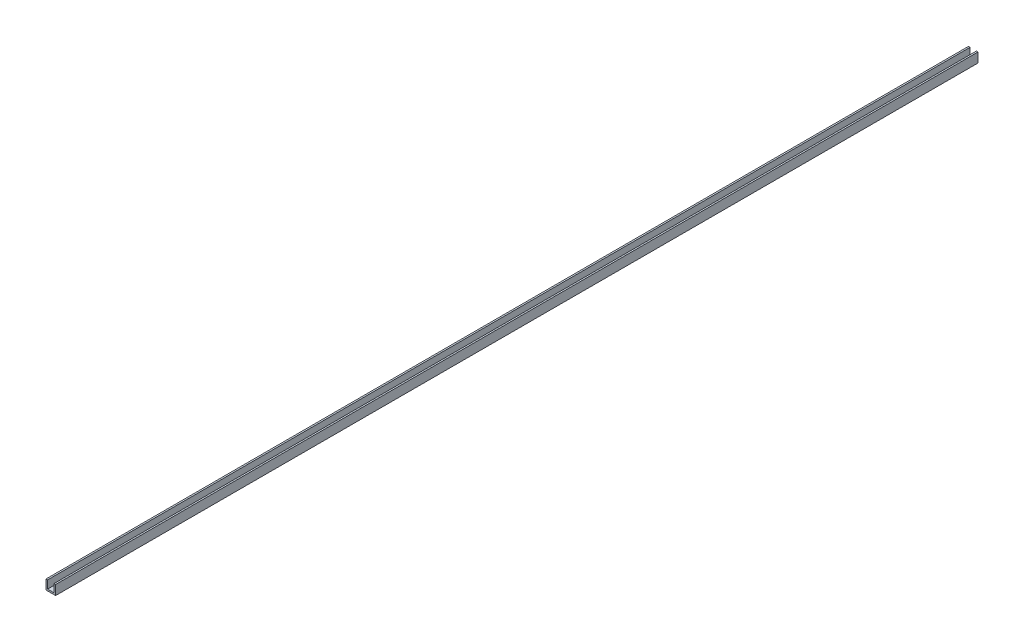
ISO-10303-21;
HEADER;
FILE_DESCRIPTION(('STEP AP214'),'2;1');
FILE_NAME('part.step','',(''),(''),'','','');
FILE_SCHEMA(('AUTOMOTIVE_DESIGN { 1 0 10303 214 1 1 1 1 }'));
ENDSEC;
DATA;
#1=APPLICATION_CONTEXT('core data for automotive mechanical design processes');
#2=APPLICATION_PROTOCOL_DEFINITION('international standard','automotive_design',2000,#1);
#3=PRODUCT_CONTEXT('',#1,'mechanical');
#4=PRODUCT('Part','Part','',(#3));
#5=PRODUCT_RELATED_PRODUCT_CATEGORY('part','',(#4));
#6=PRODUCT_DEFINITION_FORMATION('','',#4);
#7=PRODUCT_DEFINITION_CONTEXT('part definition',#1,'design');
#8=PRODUCT_DEFINITION('design','',#6,#7);
#9=PRODUCT_DEFINITION_SHAPE('','',#8);
#10=(LENGTH_UNIT() NAMED_UNIT(*) SI_UNIT(.MILLI.,.METRE.));
#11=(NAMED_UNIT(*) PLANE_ANGLE_UNIT() SI_UNIT($,.RADIAN.));
#12=(NAMED_UNIT(*) SI_UNIT($,.STERADIAN.) SOLID_ANGLE_UNIT());
#13=UNCERTAINTY_MEASURE_WITH_UNIT(LENGTH_MEASURE(1.E-05),#10,'distance_accuracy_value','');
#14=(GEOMETRIC_REPRESENTATION_CONTEXT(3) GLOBAL_UNCERTAINTY_ASSIGNED_CONTEXT((#13)) GLOBAL_UNIT_ASSIGNED_CONTEXT((#10,
#11,#12)) REPRESENTATION_CONTEXT('',''));
#15=CARTESIAN_POINT('',(0.,0.,0.));
#16=DIRECTION('',(0.,0.,1.));
#17=DIRECTION('',(1.,0.,0.));
#18=AXIS2_PLACEMENT_3D('',#15,#16,#17);
#19=CARTESIAN_POINT('',(3.175,0.,1828.8));
#20=DIRECTION('',(0.,-1.,0.));
#21=DIRECTION('',(0.,0.,-1.));
#22=AXIS2_PLACEMENT_3D('',#19,#20,#21);
#23=PLANE('',#22);
#24=DIRECTION('',(-1.,0.,0.));
#25=VECTOR('',#24,1.);
#26=CARTESIAN_POINT('',(3.175,0.,0.));
#27=LINE('',#26,#25);
#28=CARTESIAN_POINT('',(3.175,0.,0.));
#29=VERTEX_POINT('',#28);
#30=CARTESIAN_POINT('',(0.,0.,0.));
#31=VERTEX_POINT('',#30);
#32=EDGE_CURVE('E129',#29,#31,#27,.T.);
#33=ORIENTED_EDGE('',*,*,#32,.T.);
#34=DIRECTION('',(0.,0.,-1.));
#35=VECTOR('',#34,1.);
#36=CARTESIAN_POINT('',(0.,0.,1828.8));
#37=LINE('',#36,#35);
#38=CARTESIAN_POINT('',(0.,0.,1828.8));
#39=VERTEX_POINT('',#38);
#40=EDGE_CURVE('E11',#39,#31,#37,.T.);
#41=ORIENTED_EDGE('',*,*,#40,.F.);
#42=DIRECTION('',(-1.,0.,0.));
#43=VECTOR('',#42,1.);
#44=CARTESIAN_POINT('',(3.175,0.,1828.8));
#45=LINE('',#44,#43);
#46=CARTESIAN_POINT('',(3.175,0.,1828.8));
#47=VERTEX_POINT('',#46);
#48=EDGE_CURVE('E143',#47,#39,#45,.T.);
#49=ORIENTED_EDGE('',*,*,#48,.F.);
#50=DIRECTION('',(0.,0.,-1.));
#51=VECTOR('',#50,1.);
#52=CARTESIAN_POINT('',(3.175,0.,1828.8));
#53=LINE('',#52,#51);
#54=EDGE_CURVE('E125',#47,#29,#53,.T.);
#55=ORIENTED_EDGE('',*,*,#54,.T.);
#56=EDGE_LOOP('',(#33,#41,#49,#55));
#57=FACE_BOUND('',#56,.T.);
#58=ADVANCED_FACE('F33',(#57),#23,.F.);
#59=CARTESIAN_POINT('',(0.,0.,1828.8));
#60=DIRECTION('',(1.,0.,0.));
#61=DIRECTION('',(0.,1.,0.));
#62=AXIS2_PLACEMENT_3D('',#59,#60,#61);
#63=PLANE('',#62);
#64=DIRECTION('',(0.,-1.,0.));
#65=VECTOR('',#64,1.);
#66=CARTESIAN_POINT('',(0.,0.,0.));
#67=LINE('',#66,#65);
#68=CARTESIAN_POINT('',(0.,-19.05,0.));
#69=VERTEX_POINT('',#68);
#70=EDGE_CURVE('E132',#31,#69,#67,.T.);
#71=ORIENTED_EDGE('',*,*,#70,.T.);
#72=DIRECTION('',(0.,0.,-1.));
#73=VECTOR('',#72,1.);
#74=CARTESIAN_POINT('',(0.,-19.05,1828.8));
#75=LINE('',#74,#73);
#76=CARTESIAN_POINT('',(0.,-19.05,1828.8));
#77=VERTEX_POINT('',#76);
#78=EDGE_CURVE('E41',#77,#69,#75,.T.);
#79=ORIENTED_EDGE('',*,*,#78,.F.);
#80=DIRECTION('',(0.,-1.,0.));
#81=VECTOR('',#80,1.);
#82=CARTESIAN_POINT('',(0.,0.,1828.8));
#83=LINE('',#82,#81);
#84=EDGE_CURVE('E92',#39,#77,#83,.T.);
#85=ORIENTED_EDGE('',*,*,#84,.F.);
#86=ORIENTED_EDGE('',*,*,#40,.T.);
#87=EDGE_LOOP('',(#71,#79,#85,#86));
#88=FACE_BOUND('',#87,.T.);
#89=ADVANCED_FACE('F178',(#88),#63,.F.);
#90=CARTESIAN_POINT('',(0.,-19.05,1828.8));
#91=DIRECTION('',(0.,1.,0.));
#92=DIRECTION('',(0.,0.,1.));
#93=AXIS2_PLACEMENT_3D('',#90,#91,#92);
#94=PLANE('',#93);
#95=DIRECTION('',(1.,0.,0.));
#96=VECTOR('',#95,1.);
#97=CARTESIAN_POINT('',(0.,-19.05,0.));
#98=LINE('',#97,#96);
#99=CARTESIAN_POINT('',(19.05,-19.05,0.));
#100=VERTEX_POINT('',#99);
#101=EDGE_CURVE('E134',#69,#100,#98,.T.);
#102=ORIENTED_EDGE('',*,*,#101,.T.);
#103=DIRECTION('',(0.,0.,-1.));
#104=VECTOR('',#103,1.);
#105=CARTESIAN_POINT('',(19.05,-19.05,1828.8));
#106=LINE('',#105,#104);
#107=CARTESIAN_POINT('',(19.05,-19.05,1828.8));
#108=VERTEX_POINT('',#107);
#109=EDGE_CURVE('E150',#108,#100,#106,.T.);
#110=ORIENTED_EDGE('',*,*,#109,.F.);
#111=DIRECTION('',(1.,0.,0.));
#112=VECTOR('',#111,1.);
#113=CARTESIAN_POINT('',(0.,-19.05,1828.8));
#114=LINE('',#113,#112);
#115=EDGE_CURVE('E158',#77,#108,#114,.T.);
#116=ORIENTED_EDGE('',*,*,#115,.F.);
#117=ORIENTED_EDGE('',*,*,#78,.T.);
#118=EDGE_LOOP('',(#102,#110,#116,#117));
#119=FACE_BOUND('',#118,.T.);
#120=ADVANCED_FACE('F156',(#119),#94,.F.);
#121=CARTESIAN_POINT('',(19.05,-19.05,1828.8));
#122=DIRECTION('',(-1.,0.,0.));
#123=DIRECTION('',(0.,0.,1.));
#124=AXIS2_PLACEMENT_3D('',#121,#122,#123);
#125=PLANE('',#124);
#126=DIRECTION('',(0.,1.,0.));
#127=VECTOR('',#126,1.);
#128=CARTESIAN_POINT('',(19.05,-19.05,0.));
#129=LINE('',#128,#127);
#130=CARTESIAN_POINT('',(19.05,0.,0.));
#131=VERTEX_POINT('',#130);
#132=EDGE_CURVE('E136',#100,#131,#129,.T.);
#133=ORIENTED_EDGE('',*,*,#132,.T.);
#134=DIRECTION('',(0.,0.,-1.));
#135=VECTOR('',#134,1.);
#136=CARTESIAN_POINT('',(19.05,0.,1828.8));
#137=LINE('',#136,#135);
#138=CARTESIAN_POINT('',(19.05,0.,1828.8));
#139=VERTEX_POINT('',#138);
#140=EDGE_CURVE('E147',#139,#131,#137,.T.);
#141=ORIENTED_EDGE('',*,*,#140,.F.);
#142=DIRECTION('',(0.,1.,0.));
#143=VECTOR('',#142,1.);
#144=CARTESIAN_POINT('',(19.05,-19.05,1828.8));
#145=LINE('',#144,#143);
#146=EDGE_CURVE('E170',#108,#139,#145,.T.);
#147=ORIENTED_EDGE('',*,*,#146,.F.);
#148=ORIENTED_EDGE('',*,*,#109,.T.);
#149=EDGE_LOOP('',(#133,#141,#147,#148));
#150=FACE_BOUND('',#149,.T.);
#151=ADVANCED_FACE('F166',(#150),#125,.F.);
#152=CARTESIAN_POINT('',(19.05,0.,1828.8));
#153=DIRECTION('',(0.,-1.,0.));
#154=DIRECTION('',(1.,0.,0.));
#155=AXIS2_PLACEMENT_3D('',#152,#153,#154);
#156=PLANE('',#155);
#157=DIRECTION('',(-1.,0.,0.));
#158=VECTOR('',#157,1.);
#159=CARTESIAN_POINT('',(19.05,0.,0.));
#160=LINE('',#159,#158);
#161=CARTESIAN_POINT('',(15.875,0.,0.));
#162=VERTEX_POINT('',#161);
#163=EDGE_CURVE('E138',#131,#162,#160,.T.);
#164=ORIENTED_EDGE('',*,*,#163,.T.);
#165=DIRECTION('',(0.,0.,-1.));
#166=VECTOR('',#165,1.);
#167=CARTESIAN_POINT('',(15.875,0.,1828.8));
#168=LINE('',#167,#166);
#169=CARTESIAN_POINT('',(15.875,0.,1828.8));
#170=VERTEX_POINT('',#169);
#171=EDGE_CURVE('E120',#170,#162,#168,.T.);
#172=ORIENTED_EDGE('',*,*,#171,.F.);
#173=DIRECTION('',(-1.,0.,0.));
#174=VECTOR('',#173,1.);
#175=CARTESIAN_POINT('',(19.05,0.,1828.8));
#176=LINE('',#175,#174);
#177=EDGE_CURVE('E111',#139,#170,#176,.T.);
#178=ORIENTED_EDGE('',*,*,#177,.F.);
#179=ORIENTED_EDGE('',*,*,#140,.T.);
#180=EDGE_LOOP('',(#164,#172,#178,#179));
#181=FACE_BOUND('',#180,.T.);
#182=ADVANCED_FACE('F169',(#181),#156,.F.);
#183=CARTESIAN_POINT('',(15.875,0.,1828.8));
#184=DIRECTION('',(1.,0.,0.));
#185=DIRECTION('',(0.,1.,0.));
#186=AXIS2_PLACEMENT_3D('',#183,#184,#185);
#187=PLANE('',#186);
#188=DIRECTION('',(0.,-1.,0.));
#189=VECTOR('',#188,1.);
#190=CARTESIAN_POINT('',(15.875,0.,0.));
#191=LINE('',#190,#189);
#192=CARTESIAN_POINT('',(15.875,-15.875,0.));
#193=VERTEX_POINT('',#192);
#194=EDGE_CURVE('E119',#162,#193,#191,.T.);
#195=ORIENTED_EDGE('',*,*,#194,.T.);
#196=DIRECTION('',(0.,0.,-1.));
#197=VECTOR('',#196,1.);
#198=CARTESIAN_POINT('',(15.875,-15.875,1828.8));
#199=LINE('',#198,#197);
#200=CARTESIAN_POINT('',(15.875,-15.875,1828.8));
#201=VERTEX_POINT('',#200);
#202=EDGE_CURVE('E116',#201,#193,#199,.T.);
#203=ORIENTED_EDGE('',*,*,#202,.F.);
#204=DIRECTION('',(0.,-1.,0.));
#205=VECTOR('',#204,1.);
#206=CARTESIAN_POINT('',(15.875,0.,1828.8));
#207=LINE('',#206,#205);
#208=EDGE_CURVE('E105',#170,#201,#207,.T.);
#209=ORIENTED_EDGE('',*,*,#208,.F.);
#210=ORIENTED_EDGE('',*,*,#171,.T.);
#211=EDGE_LOOP('',(#195,#203,#209,#210));
#212=FACE_BOUND('',#211,.T.);
#213=ADVANCED_FACE('F117',(#212),#187,.F.);
#214=CARTESIAN_POINT('',(15.875,-15.875,1828.8));
#215=DIRECTION('',(0.,-1.,0.));
#216=DIRECTION('',(0.,0.,-1.));
#217=AXIS2_PLACEMENT_3D('',#214,#215,#216);
#218=PLANE('',#217);
#219=DIRECTION('',(-1.,0.,0.));
#220=VECTOR('',#219,1.);
#221=CARTESIAN_POINT('',(15.875,-15.875,0.));
#222=LINE('',#221,#220);
#223=CARTESIAN_POINT('',(3.175,-15.875,0.));
#224=VERTEX_POINT('',#223);
#225=EDGE_CURVE('E78',#193,#224,#222,.T.);
#226=ORIENTED_EDGE('',*,*,#225,.T.);
#227=DIRECTION('',(0.,0.,-1.));
#228=VECTOR('',#227,1.);
#229=CARTESIAN_POINT('',(3.175,-15.875,1828.8));
#230=LINE('',#229,#228);
#231=CARTESIAN_POINT('',(3.175,-15.875,1828.8));
#232=VERTEX_POINT('',#231);
#233=EDGE_CURVE('E121',#232,#224,#230,.T.);
#234=ORIENTED_EDGE('',*,*,#233,.F.);
#235=DIRECTION('',(-1.,0.,0.));
#236=VECTOR('',#235,1.);
#237=CARTESIAN_POINT('',(15.875,-15.875,1828.8));
#238=LINE('',#237,#236);
#239=EDGE_CURVE('E109',#201,#232,#238,.T.);
#240=ORIENTED_EDGE('',*,*,#239,.F.);
#241=ORIENTED_EDGE('',*,*,#202,.T.);
#242=EDGE_LOOP('',(#226,#234,#240,#241));
#243=FACE_BOUND('',#242,.T.);
#244=ADVANCED_FACE('F123',(#243),#218,.F.);
#245=CARTESIAN_POINT('',(3.175,-15.875,1828.8));
#246=DIRECTION('',(-1.,0.,0.));
#247=DIRECTION('',(0.,0.,1.));
#248=AXIS2_PLACEMENT_3D('',#245,#246,#247);
#249=PLANE('',#248);
#250=DIRECTION('',(0.,1.,0.));
#251=VECTOR('',#250,1.);
#252=CARTESIAN_POINT('',(3.175,-15.875,0.));
#253=LINE('',#252,#251);
#254=EDGE_CURVE('E84',#224,#29,#253,.T.);
#255=ORIENTED_EDGE('',*,*,#254,.T.);
#256=ORIENTED_EDGE('',*,*,#54,.F.);
#257=DIRECTION('',(0.,1.,0.));
#258=VECTOR('',#257,1.);
#259=CARTESIAN_POINT('',(3.175,-15.875,1828.8));
#260=LINE('',#259,#258);
#261=EDGE_CURVE('E49',#232,#47,#260,.T.);
#262=ORIENTED_EDGE('',*,*,#261,.F.);
#263=ORIENTED_EDGE('',*,*,#233,.T.);
#264=EDGE_LOOP('',(#255,#256,#262,#263));
#265=FACE_BOUND('',#264,.T.);
#266=ADVANCED_FACE('F194',(#265),#249,.F.);
#267=CARTESIAN_POINT('',(0.,0.,1828.8));
#268=DIRECTION('',(0.,0.,1.));
#269=DIRECTION('',(1.,0.,0.));
#270=AXIS2_PLACEMENT_3D('',#267,#268,#269);
#271=PLANE('',#270);
#272=ORIENTED_EDGE('',*,*,#48,.T.);
#273=ORIENTED_EDGE('',*,*,#84,.T.);
#274=ORIENTED_EDGE('',*,*,#115,.T.);
#275=ORIENTED_EDGE('',*,*,#146,.T.);
#276=ORIENTED_EDGE('',*,*,#177,.T.);
#277=ORIENTED_EDGE('',*,*,#208,.T.);
#278=ORIENTED_EDGE('',*,*,#239,.T.);
#279=ORIENTED_EDGE('',*,*,#261,.T.);
#280=EDGE_LOOP('',(#272,#273,#274,#275,#276,#277,#278,#279));
#281=FACE_BOUND('',#280,.T.);
#282=ADVANCED_FACE('F107',(#281),#271,.T.);
#283=CARTESIAN_POINT('',(0.,0.,0.));
#284=DIRECTION('',(0.,0.,1.));
#285=DIRECTION('',(1.,0.,0.));
#286=AXIS2_PLACEMENT_3D('',#283,#284,#285);
#287=PLANE('',#286);
#288=ORIENTED_EDGE('',*,*,#32,.F.);
#289=ORIENTED_EDGE('',*,*,#254,.F.);
#290=ORIENTED_EDGE('',*,*,#225,.F.);
#291=ORIENTED_EDGE('',*,*,#194,.F.);
#292=ORIENTED_EDGE('',*,*,#163,.F.);
#293=ORIENTED_EDGE('',*,*,#132,.F.);
#294=ORIENTED_EDGE('',*,*,#101,.F.);
#295=ORIENTED_EDGE('',*,*,#70,.F.);
#296=EDGE_LOOP('',(#288,#289,#290,#291,#292,#293,#294,#295));
#297=FACE_BOUND('',#296,.T.);
#298=ADVANCED_FACE('F162',(#297),#287,.F.);
#299=CLOSED_SHELL('',(#58,#89,#120,#151,#182,#213,#244,#266,#282,#298));
#300=MANIFOLD_SOLID_BREP('B2',#299);
#301=ADVANCED_BREP_SHAPE_REPRESENTATION('',(#18,#300),#14);
#302=SHAPE_DEFINITION_REPRESENTATION(#9,#301);
ENDSEC;
END-ISO-10303-21;
